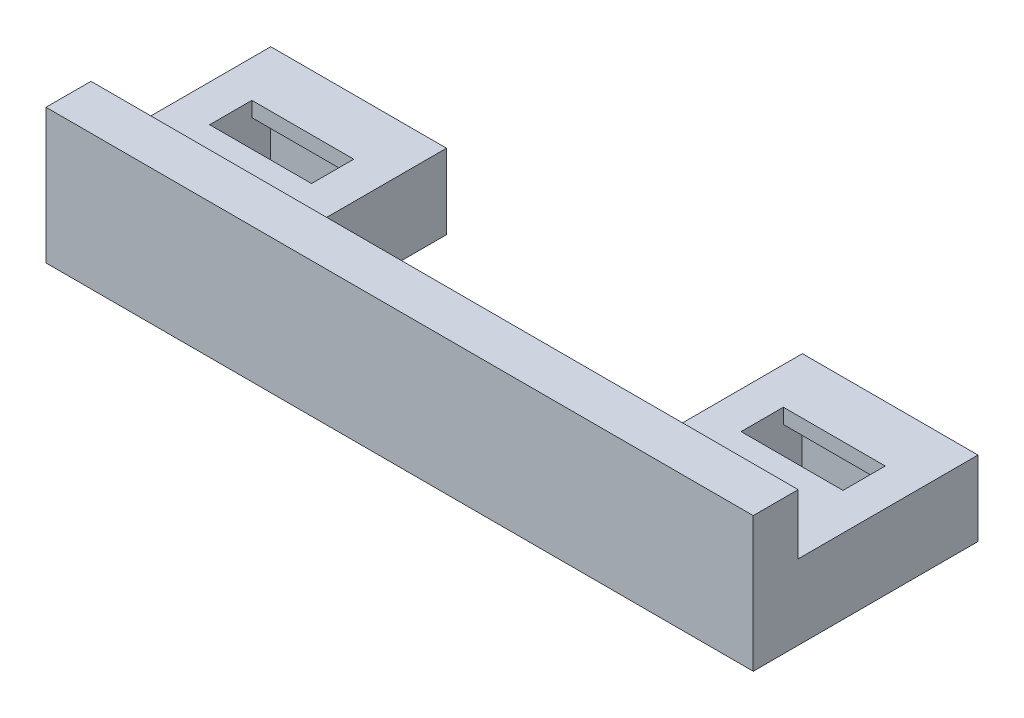
ISO-10303-21;
HEADER;
FILE_DESCRIPTION(('STEP AP214'),'2;1');
FILE_NAME('part.step','',(''),(''),'','','');
FILE_SCHEMA(('AUTOMOTIVE_DESIGN { 1 0 10303 214 1 1 1 1 }'));
ENDSEC;
DATA;
#1=APPLICATION_CONTEXT('core data for automotive mechanical design processes');
#2=APPLICATION_PROTOCOL_DEFINITION('international standard','automotive_design',2000,#1);
#3=PRODUCT_CONTEXT('',#1,'mechanical');
#4=PRODUCT('Part','Part','',(#3));
#5=PRODUCT_RELATED_PRODUCT_CATEGORY('part','',(#4));
#6=PRODUCT_DEFINITION_FORMATION('','',#4);
#7=PRODUCT_DEFINITION_CONTEXT('part definition',#1,'design');
#8=PRODUCT_DEFINITION('design','',#6,#7);
#9=PRODUCT_DEFINITION_SHAPE('','',#8);
#10=(LENGTH_UNIT() NAMED_UNIT(*) SI_UNIT(.MILLI.,.METRE.));
#11=(NAMED_UNIT(*) PLANE_ANGLE_UNIT() SI_UNIT($,.RADIAN.));
#12=(NAMED_UNIT(*) SI_UNIT($,.STERADIAN.) SOLID_ANGLE_UNIT());
#13=UNCERTAINTY_MEASURE_WITH_UNIT(LENGTH_MEASURE(1.E-05),#10,'distance_accuracy_value','');
#14=(GEOMETRIC_REPRESENTATION_CONTEXT(3) GLOBAL_UNCERTAINTY_ASSIGNED_CONTEXT((#13)) GLOBAL_UNIT_ASSIGNED_CONTEXT((#10,
#11,#12)) REPRESENTATION_CONTEXT('',''));
#15=CARTESIAN_POINT('',(0.,0.,0.));
#16=DIRECTION('',(0.,0.,1.));
#17=DIRECTION('',(1.,0.,0.));
#18=AXIS2_PLACEMENT_3D('',#15,#16,#17);
#19=CARTESIAN_POINT('',(0.,6.35,0.));
#20=DIRECTION('',(0.,-1.,0.));
#21=DIRECTION('',(0.,0.,-1.));
#22=AXIS2_PLACEMENT_3D('',#19,#20,#21);
#23=PLANE('',#22);
#24=DIRECTION('',(0.,0.,1.));
#25=VECTOR('',#24,1.);
#26=CARTESIAN_POINT('',(-11.238643735867,6.35,-23.8215313644361));
#27=LINE('',#26,#25);
#28=CARTESIAN_POINT('',(-11.238643735867,6.35,-23.8215313644361));
#29=VERTEX_POINT('',#28);
#30=CARTESIAN_POINT('',(-11.238643735867,6.35,-20.2401313644361));
#31=VERTEX_POINT('',#30);
#32=EDGE_CURVE('E257',#29,#31,#27,.T.);
#33=ORIENTED_EDGE('',*,*,#32,.F.);
#34=DIRECTION('',(-1.,0.,0.));
#35=VECTOR('',#34,1.);
#36=CARTESIAN_POINT('',(-11.238643735867,6.35,-23.8215313644361));
#37=LINE('',#36,#35);
#38=CARTESIAN_POINT('',(-2.60264373586703,6.35,-23.8215313644361));
#39=VERTEX_POINT('',#38);
#40=EDGE_CURVE('E265',#39,#29,#37,.T.);
#41=ORIENTED_EDGE('',*,*,#40,.F.);
#42=DIRECTION('',(0.,0.,-1.));
#43=VECTOR('',#42,1.);
#44=CARTESIAN_POINT('',(-2.60264373586703,6.35,-23.8215313644361));
#45=LINE('',#44,#43);
#46=CARTESIAN_POINT('',(-2.60264373586703,6.35,-20.2401313644361));
#47=VERTEX_POINT('',#46);
#48=EDGE_CURVE('E262',#47,#39,#45,.T.);
#49=ORIENTED_EDGE('',*,*,#48,.F.);
#50=DIRECTION('',(1.,0.,0.));
#51=VECTOR('',#50,1.);
#52=CARTESIAN_POINT('',(-11.238643735867,6.35,-20.2401313644361));
#53=LINE('',#52,#51);
#54=EDGE_CURVE('E259',#31,#47,#53,.T.);
#55=ORIENTED_EDGE('',*,*,#54,.F.);
#56=EDGE_LOOP('',(#33,#41,#49,#55));
#57=FACE_BOUND('',#56,.T.);
#58=DIRECTION('',(0.,0.,1.));
#59=VECTOR('',#58,1.);
#60=CARTESIAN_POINT('',(-56.285543735867,6.35,-23.8215313644361));
#61=LINE('',#60,#59);
#62=CARTESIAN_POINT('',(-56.285543735867,6.35,-23.8215313644361));
#63=VERTEX_POINT('',#62);
#64=CARTESIAN_POINT('',(-56.285543735867,6.35,-20.2401313644361));
#65=VERTEX_POINT('',#64);
#66=EDGE_CURVE('E282',#63,#65,#61,.T.);
#67=ORIENTED_EDGE('',*,*,#66,.F.);
#68=DIRECTION('',(-1.,0.,0.));
#69=VECTOR('',#68,1.);
#70=CARTESIAN_POINT('',(-56.285543735867,6.35,-23.8215313644361));
#71=LINE('',#70,#69);
#72=CARTESIAN_POINT('',(-47.649543735867,6.35,-23.8215313644361));
#73=VERTEX_POINT('',#72);
#74=EDGE_CURVE('E290',#73,#63,#71,.T.);
#75=ORIENTED_EDGE('',*,*,#74,.F.);
#76=DIRECTION('',(0.,0.,-1.));
#77=VECTOR('',#76,1.);
#78=CARTESIAN_POINT('',(-47.649543735867,6.35,-23.8215313644361));
#79=LINE('',#78,#77);
#80=CARTESIAN_POINT('',(-47.649543735867,6.35,-20.2401313644361));
#81=VERTEX_POINT('',#80);
#82=EDGE_CURVE('E287',#81,#73,#79,.T.);
#83=ORIENTED_EDGE('',*,*,#82,.F.);
#84=DIRECTION('',(1.,0.,0.));
#85=VECTOR('',#84,1.);
#86=CARTESIAN_POINT('',(-56.285543735867,6.35,-20.2401313644361));
#87=LINE('',#86,#85);
#88=EDGE_CURVE('E284',#65,#81,#87,.T.);
#89=ORIENTED_EDGE('',*,*,#88,.F.);
#90=EDGE_LOOP('',(#67,#75,#83,#89));
#91=FACE_BOUND('',#90,.T.);
#92=DIRECTION('',(-1.,0.,0.));
#93=VECTOR('',#92,1.);
#94=CARTESIAN_POINT('',(-59.422443735867,6.35,-13.3186313644361));
#95=LINE('',#94,#93);
#96=CARTESIAN_POINT('',(0.521556264132972,6.35,-13.3186313644361));
#97=VERTEX_POINT('',#96);
#98=CARTESIAN_POINT('',(-59.422443735867,6.35,-13.3186313644361));
#99=VERTEX_POINT('',#98);
#100=EDGE_CURVE('E48',#97,#99,#95,.T.);
#101=ORIENTED_EDGE('',*,*,#100,.F.);
#102=DIRECTION('',(0.,0.,-1.));
#103=VECTOR('',#102,1.);
#104=CARTESIAN_POINT('',(0.521556264132972,6.35,-9.50863136443608));
#105=LINE('',#104,#103);
#106=CARTESIAN_POINT('',(0.521556264132972,6.35,-28.5586313644361));
#107=VERTEX_POINT('',#106);
#108=EDGE_CURVE('E308',#97,#107,#105,.T.);
#109=ORIENTED_EDGE('',*,*,#108,.T.);
#110=DIRECTION('',(-1.,0.,0.));
#111=VECTOR('',#110,1.);
#112=CARTESIAN_POINT('',(-59.422443735867,6.35,-28.5586313644361));
#113=LINE('',#112,#111);
#114=CARTESIAN_POINT('',(-14.362843735867,6.35,-28.5586313644361));
#115=VERTEX_POINT('',#114);
#116=EDGE_CURVE('E311',#107,#115,#113,.T.);
#117=ORIENTED_EDGE('',*,*,#116,.T.);
#118=DIRECTION('',(0.,0.,1.));
#119=VECTOR('',#118,1.);
#120=CARTESIAN_POINT('',(-14.362843735867,6.35,0.));
#121=LINE('',#120,#119);
#122=CARTESIAN_POINT('',(-14.362843735867,6.35,-15.5284313644361));
#123=VERTEX_POINT('',#122);
#124=EDGE_CURVE('E11',#115,#123,#121,.T.);
#125=ORIENTED_EDGE('',*,*,#124,.T.);
#126=DIRECTION('',(-1.,0.,0.));
#127=VECTOR('',#126,1.);
#128=CARTESIAN_POINT('',(0.,6.35,-15.5284313644361));
#129=LINE('',#128,#127);
#130=CARTESIAN_POINT('',(-44.525343735867,6.35,-15.5284313644361));
#131=VERTEX_POINT('',#130);
#132=EDGE_CURVE('E216',#123,#131,#129,.T.);
#133=ORIENTED_EDGE('',*,*,#132,.T.);
#134=DIRECTION('',(0.,0.,-1.));
#135=VECTOR('',#134,1.);
#136=CARTESIAN_POINT('',(-44.525343735867,6.35,0.));
#137=LINE('',#136,#135);
#138=CARTESIAN_POINT('',(-44.525343735867,6.35,-28.5586313644361));
#139=VERTEX_POINT('',#138);
#140=EDGE_CURVE('E41',#131,#139,#137,.T.);
#141=ORIENTED_EDGE('',*,*,#140,.T.);
#142=CARTESIAN_POINT('',(-59.422443735867,6.35,-28.5586313644361));
#143=VERTEX_POINT('',#142);
#144=EDGE_CURVE('E310',#139,#143,#113,.T.);
#145=ORIENTED_EDGE('',*,*,#144,.T.);
#146=DIRECTION('',(0.,0.,1.));
#147=VECTOR('',#146,1.);
#148=CARTESIAN_POINT('',(-59.422443735867,6.35,-9.50863136443608));
#149=LINE('',#148,#147);
#150=EDGE_CURVE('E306',#143,#99,#149,.T.);
#151=ORIENTED_EDGE('',*,*,#150,.T.);
#152=EDGE_LOOP('',(#101,#109,#117,#125,#133,#141,#145,#151));
#153=FACE_BOUND('',#152,.T.);
#154=ADVANCED_FACE('F33',(#57,#91,#153),#23,.F.);
#155=CARTESIAN_POINT('',(-59.422443735867,5.08,-28.5586313644361));
#156=DIRECTION('',(0.,0.,1.));
#157=DIRECTION('',(1.,0.,0.));
#158=AXIS2_PLACEMENT_3D('',#155,#156,#157);
#159=PLANE('',#158);
#160=DIRECTION('',(-1.,0.,0.));
#161=VECTOR('',#160,1.);
#162=CARTESIAN_POINT('',(-59.422443735867,0.,-28.5586313644361));
#163=LINE('',#162,#161);
#164=CARTESIAN_POINT('',(0.521556264132972,0.,-28.5586313644361));
#165=VERTEX_POINT('',#164);
#166=CARTESIAN_POINT('',(-14.362843735867,0.,-28.5586313644361));
#167=VERTEX_POINT('',#166);
#168=EDGE_CURVE('E392',#165,#167,#163,.T.);
#169=ORIENTED_EDGE('',*,*,#168,.T.);
#170=DIRECTION('',(0.,-1.,0.));
#171=VECTOR('',#170,1.);
#172=CARTESIAN_POINT('',(-14.362843735867,30.48,-28.5586313644361));
#173=LINE('',#172,#171);
#174=EDGE_CURVE('E249',#115,#167,#173,.T.);
#175=ORIENTED_EDGE('',*,*,#174,.F.);
#176=ORIENTED_EDGE('',*,*,#116,.F.);
#177=DIRECTION('',(0.,-1.,0.));
#178=VECTOR('',#177,1.);
#179=CARTESIAN_POINT('',(0.521556264132972,5.08,-28.5586313644361));
#180=LINE('',#179,#178);
#181=EDGE_CURVE('E397',#107,#165,#180,.T.);
#182=ORIENTED_EDGE('',*,*,#181,.T.);
#183=EDGE_LOOP('',(#169,#175,#176,#182));
#184=FACE_BOUND('',#183,.T.);
#185=ADVANCED_FACE('F419',(#184),#159,.F.);
#186=CARTESIAN_POINT('',(0.,0.,0.));
#187=DIRECTION('',(0.,1.,0.));
#188=DIRECTION('',(0.,0.,1.));
#189=AXIS2_PLACEMENT_3D('',#186,#187,#188);
#190=PLANE('',#189);
#191=DIRECTION('',(0.,0.,-1.));
#192=VECTOR('',#191,1.);
#193=CARTESIAN_POINT('',(-47.649543735867,0.,-18.6526313644361));
#194=LINE('',#193,#192);
#195=CARTESIAN_POINT('',(-47.649543735867,0.,-18.6526313644361));
#196=VERTEX_POINT('',#195);
#197=CARTESIAN_POINT('',(-47.649543735867,0.,-25.4090313644361));
#198=VERTEX_POINT('',#197);
#199=EDGE_CURVE('E350',#196,#198,#194,.T.);
#200=ORIENTED_EDGE('',*,*,#199,.T.);
#201=DIRECTION('',(-1.,0.,0.));
#202=VECTOR('',#201,1.);
#203=CARTESIAN_POINT('',(-47.649543735867,0.,-25.4090313644361));
#204=LINE('',#203,#202);
#205=CARTESIAN_POINT('',(-56.285543735867,0.,-25.4090313644361));
#206=VERTEX_POINT('',#205);
#207=EDGE_CURVE('E368',#198,#206,#204,.T.);
#208=ORIENTED_EDGE('',*,*,#207,.T.);
#209=DIRECTION('',(0.,0.,1.));
#210=VECTOR('',#209,1.);
#211=CARTESIAN_POINT('',(-56.285543735867,0.,-18.6526313644361));
#212=LINE('',#211,#210);
#213=CARTESIAN_POINT('',(-56.285543735867,0.,-18.6526313644361));
#214=VERTEX_POINT('',#213);
#215=EDGE_CURVE('E371',#206,#214,#212,.T.);
#216=ORIENTED_EDGE('',*,*,#215,.T.);
#217=DIRECTION('',(1.,0.,0.));
#218=VECTOR('',#217,1.);
#219=CARTESIAN_POINT('',(-47.649543735867,0.,-18.6526313644361));
#220=LINE('',#219,#218);
#221=EDGE_CURVE('E374',#214,#196,#220,.T.);
#222=ORIENTED_EDGE('',*,*,#221,.T.);
#223=EDGE_LOOP('',(#200,#208,#216,#222));
#224=FACE_BOUND('',#223,.T.);
#225=DIRECTION('',(-1.,0.,0.));
#226=VECTOR('',#225,1.);
#227=CARTESIAN_POINT('',(-14.362843735867,0.,-15.5284313644361));
#228=LINE('',#227,#226);
#229=CARTESIAN_POINT('',(-14.362843735867,0.,-15.5284313644361));
#230=VERTEX_POINT('',#229);
#231=CARTESIAN_POINT('',(-44.525343735867,0.,-15.5284313644361));
#232=VERTEX_POINT('',#231);
#233=EDGE_CURVE('E244',#230,#232,#228,.T.);
#234=ORIENTED_EDGE('',*,*,#233,.F.);
#235=DIRECTION('',(0.,0.,1.));
#236=VECTOR('',#235,1.);
#237=CARTESIAN_POINT('',(-14.362843735867,0.,-28.5586313644361));
#238=LINE('',#237,#236);
#239=EDGE_CURVE('E241',#167,#230,#238,.T.);
#240=ORIENTED_EDGE('',*,*,#239,.F.);
#241=ORIENTED_EDGE('',*,*,#168,.F.);
#242=DIRECTION('',(0.,0.,-1.));
#243=VECTOR('',#242,1.);
#244=CARTESIAN_POINT('',(0.521556264132972,0.,-28.5586313644361));
#245=LINE('',#244,#243);
#246=CARTESIAN_POINT('',(0.521556264132974,0.,-9.50863136443608));
#247=VERTEX_POINT('',#246);
#248=EDGE_CURVE('E389',#247,#165,#245,.T.);
#249=ORIENTED_EDGE('',*,*,#248,.F.);
#250=DIRECTION('',(1.,0.,0.));
#251=VECTOR('',#250,1.);
#252=CARTESIAN_POINT('',(-59.422443735867,0.,-9.50863136443608));
#253=LINE('',#252,#251);
#254=CARTESIAN_POINT('',(-59.422443735867,0.,-9.50863136443608));
#255=VERTEX_POINT('',#254);
#256=EDGE_CURVE('E387',#255,#247,#253,.T.);
#257=ORIENTED_EDGE('',*,*,#256,.F.);
#258=DIRECTION('',(0.,0.,1.));
#259=VECTOR('',#258,1.);
#260=CARTESIAN_POINT('',(-59.422443735867,0.,-28.5586313644361));
#261=LINE('',#260,#259);
#262=CARTESIAN_POINT('',(-59.422443735867,0.,-28.5586313644361));
#263=VERTEX_POINT('',#262);
#264=EDGE_CURVE('E214',#263,#255,#261,.T.);
#265=ORIENTED_EDGE('',*,*,#264,.F.);
#266=CARTESIAN_POINT('',(-44.525343735867,0.,-28.5586313644361));
#267=VERTEX_POINT('',#266);
#268=EDGE_CURVE('E391',#267,#263,#163,.T.);
#269=ORIENTED_EDGE('',*,*,#268,.F.);
#270=DIRECTION('',(0.,0.,-1.));
#271=VECTOR('',#270,1.);
#272=CARTESIAN_POINT('',(-44.525343735867,0.,-28.5586313644361));
#273=LINE('',#272,#271);
#274=EDGE_CURVE('E246',#232,#267,#273,.T.);
#275=ORIENTED_EDGE('',*,*,#274,.F.);
#276=EDGE_LOOP('',(#234,#240,#241,#249,#257,#265,#269,#275));
#277=FACE_BOUND('',#276,.T.);
#278=DIRECTION('',(0.,0.,1.));
#279=VECTOR('',#278,1.);
#280=CARTESIAN_POINT('',(-11.238643735867,0.,-18.6526313644361));
#281=LINE('',#280,#279);
#282=CARTESIAN_POINT('',(-11.238643735867,0.,-25.4090313644361));
#283=VERTEX_POINT('',#282);
#284=CARTESIAN_POINT('',(-11.238643735867,0.,-18.6526313644361));
#285=VERTEX_POINT('',#284);
#286=EDGE_CURVE('E314',#283,#285,#281,.T.);
#287=ORIENTED_EDGE('',*,*,#286,.T.);
#288=DIRECTION('',(1.,0.,0.));
#289=VECTOR('',#288,1.);
#290=CARTESIAN_POINT('',(-11.238643735867,0.,-18.6526313644361));
#291=LINE('',#290,#289);
#292=CARTESIAN_POINT('',(-2.60264373586703,0.,-18.6526313644361));
#293=VERTEX_POINT('',#292);
#294=EDGE_CURVE('E332',#285,#293,#291,.T.);
#295=ORIENTED_EDGE('',*,*,#294,.T.);
#296=DIRECTION('',(0.,0.,-1.));
#297=VECTOR('',#296,1.);
#298=CARTESIAN_POINT('',(-2.60264373586703,0.,-18.6526313644361));
#299=LINE('',#298,#297);
#300=CARTESIAN_POINT('',(-2.60264373586703,0.,-25.4090313644361));
#301=VERTEX_POINT('',#300);
#302=EDGE_CURVE('E335',#293,#301,#299,.T.);
#303=ORIENTED_EDGE('',*,*,#302,.T.);
#304=DIRECTION('',(-1.,0.,0.));
#305=VECTOR('',#304,1.);
#306=CARTESIAN_POINT('',(-11.238643735867,0.,-25.4090313644361));
#307=LINE('',#306,#305);
#308=EDGE_CURVE('E338',#301,#283,#307,.T.);
#309=ORIENTED_EDGE('',*,*,#308,.T.);
#310=EDGE_LOOP('',(#287,#295,#303,#309));
#311=FACE_BOUND('',#310,.T.);
#312=ADVANCED_FACE('F427',(#224,#277,#311),#190,.F.);
#313=CARTESIAN_POINT('',(-59.422443735867,5.08,-28.5586313644361));
#314=DIRECTION('',(1.,0.,0.));
#315=DIRECTION('',(0.,0.,-1.));
#316=AXIS2_PLACEMENT_3D('',#313,#314,#315);
#317=PLANE('',#316);
#318=ORIENTED_EDGE('',*,*,#264,.T.);
#319=DIRECTION('',(0.,-1.,0.));
#320=VECTOR('',#319,1.);
#321=CARTESIAN_POINT('',(-59.422443735867,5.08,-9.50863136443608));
#322=LINE('',#321,#320);
#323=CARTESIAN_POINT('',(-59.422443735867,11.43,-9.50863136443608));
#324=VERTEX_POINT('',#323);
#325=EDGE_CURVE('E207',#324,#255,#322,.T.);
#326=ORIENTED_EDGE('',*,*,#325,.F.);
#327=DIRECTION('',(0.,0.,1.));
#328=VECTOR('',#327,1.);
#329=CARTESIAN_POINT('',(-59.422443735867,11.43,-9.50863136443608));
#330=LINE('',#329,#328);
#331=CARTESIAN_POINT('',(-59.422443735867,11.43,-13.3186313644361));
#332=VERTEX_POINT('',#331);
#333=EDGE_CURVE('E211',#332,#324,#330,.T.);
#334=ORIENTED_EDGE('',*,*,#333,.F.);
#335=DIRECTION('',(0.,-1.,0.));
#336=VECTOR('',#335,1.);
#337=CARTESIAN_POINT('',(-59.422443735867,11.43,-13.3186313644361));
#338=LINE('',#337,#336);
#339=EDGE_CURVE('E235',#332,#99,#338,.T.);
#340=ORIENTED_EDGE('',*,*,#339,.T.);
#341=ORIENTED_EDGE('',*,*,#150,.F.);
#342=DIRECTION('',(0.,-1.,0.));
#343=VECTOR('',#342,1.);
#344=CARTESIAN_POINT('',(-59.422443735867,5.08,-28.5586313644361));
#345=LINE('',#344,#343);
#346=EDGE_CURVE('E395',#143,#263,#345,.T.);
#347=ORIENTED_EDGE('',*,*,#346,.T.);
#348=EDGE_LOOP('',(#318,#326,#334,#340,#341,#347));
#349=FACE_BOUND('',#348,.T.);
#350=ADVANCED_FACE('F35',(#349),#317,.F.);
#351=CARTESIAN_POINT('',(-59.422443735867,5.08,-9.50863136443608));
#352=DIRECTION('',(0.,0.,-1.));
#353=DIRECTION('',(-1.,0.,0.));
#354=AXIS2_PLACEMENT_3D('',#351,#352,#353);
#355=PLANE('',#354);
#356=ORIENTED_EDGE('',*,*,#256,.T.);
#357=DIRECTION('',(0.,-1.,0.));
#358=VECTOR('',#357,1.);
#359=CARTESIAN_POINT('',(0.521556264132974,5.08,-9.50863136443608));
#360=LINE('',#359,#358);
#361=CARTESIAN_POINT('',(0.521556264132972,11.43,-9.50863136443608));
#362=VERTEX_POINT('',#361);
#363=EDGE_CURVE('E217',#362,#247,#360,.T.);
#364=ORIENTED_EDGE('',*,*,#363,.F.);
#365=DIRECTION('',(1.,0.,0.));
#366=VECTOR('',#365,1.);
#367=CARTESIAN_POINT('',(-59.422443735867,11.43,-9.50863136443608));
#368=LINE('',#367,#366);
#369=EDGE_CURVE('E220',#324,#362,#368,.T.);
#370=ORIENTED_EDGE('',*,*,#369,.F.);
#371=ORIENTED_EDGE('',*,*,#325,.T.);
#372=EDGE_LOOP('',(#356,#364,#370,#371));
#373=FACE_BOUND('',#372,.T.);
#374=ADVANCED_FACE('F221',(#373),#355,.F.);
#375=CARTESIAN_POINT('',(0.521556264132972,5.08,-28.5586313644361));
#376=DIRECTION('',(-1.,0.,0.));
#377=DIRECTION('',(0.,0.,1.));
#378=AXIS2_PLACEMENT_3D('',#375,#376,#377);
#379=PLANE('',#378);
#380=ORIENTED_EDGE('',*,*,#248,.T.);
#381=ORIENTED_EDGE('',*,*,#181,.F.);
#382=ORIENTED_EDGE('',*,*,#108,.F.);
#383=DIRECTION('',(0.,-1.,0.));
#384=VECTOR('',#383,1.);
#385=CARTESIAN_POINT('',(0.521556264132972,11.43,-13.3186313644361));
#386=LINE('',#385,#384);
#387=CARTESIAN_POINT('',(0.521556264132972,11.43,-13.3186313644361));
#388=VERTEX_POINT('',#387);
#389=EDGE_CURVE('E238',#388,#97,#386,.T.);
#390=ORIENTED_EDGE('',*,*,#389,.F.);
#391=DIRECTION('',(0.,0.,-1.));
#392=VECTOR('',#391,1.);
#393=CARTESIAN_POINT('',(0.521556264132972,11.43,-9.50863136443608));
#394=LINE('',#393,#392);
#395=EDGE_CURVE('E225',#362,#388,#394,.T.);
#396=ORIENTED_EDGE('',*,*,#395,.F.);
#397=ORIENTED_EDGE('',*,*,#363,.T.);
#398=EDGE_LOOP('',(#380,#381,#382,#390,#396,#397));
#399=FACE_BOUND('',#398,.T.);
#400=ADVANCED_FACE('F414',(#399),#379,.F.);
#401=ORIENTED_EDGE('',*,*,#144,.F.);
#402=DIRECTION('',(0.,-1.,0.));
#403=VECTOR('',#402,1.);
#404=CARTESIAN_POINT('',(-44.525343735867,30.48,-28.5586313644361));
#405=LINE('',#404,#403);
#406=EDGE_CURVE('E252',#139,#267,#405,.T.);
#407=ORIENTED_EDGE('',*,*,#406,.T.);
#408=ORIENTED_EDGE('',*,*,#268,.T.);
#409=ORIENTED_EDGE('',*,*,#346,.F.);
#410=EDGE_LOOP('',(#401,#407,#408,#409));
#411=FACE_BOUND('',#410,.T.);
#412=ADVANCED_FACE('F407',(#411),#159,.F.);
#413=CARTESIAN_POINT('',(-47.649543735867,5.08,-18.6526313644361));
#414=DIRECTION('',(-1.,0.,0.));
#415=DIRECTION('',(0.,0.,1.));
#416=AXIS2_PLACEMENT_3D('',#413,#414,#415);
#417=PLANE('',#416);
#418=ORIENTED_EDGE('',*,*,#199,.F.);
#419=DIRECTION('',(0.,-1.,0.));
#420=VECTOR('',#419,1.);
#421=CARTESIAN_POINT('',(-47.649543735867,5.08,-18.6526313644361));
#422=LINE('',#421,#420);
#423=CARTESIAN_POINT('',(-47.649543735867,5.08,-18.6526313644361));
#424=VERTEX_POINT('',#423);
#425=EDGE_CURVE('E365',#424,#196,#422,.T.);
#426=ORIENTED_EDGE('',*,*,#425,.F.);
#427=DIRECTION('',(0.,0.,-1.));
#428=VECTOR('',#427,1.);
#429=CARTESIAN_POINT('',(-47.649543735867,5.08,-18.6526313644361));
#430=LINE('',#429,#428);
#431=CARTESIAN_POINT('',(-47.649543735867,5.08,-20.2401313644361));
#432=VERTEX_POINT('',#431);
#433=EDGE_CURVE('E351',#424,#432,#430,.T.);
#434=ORIENTED_EDGE('',*,*,#433,.T.);
#435=DIRECTION('',(0.,-1.,0.));
#436=VECTOR('',#435,1.);
#437=CARTESIAN_POINT('',(-47.649543735867,6.35,-20.2401313644361));
#438=LINE('',#437,#436);
#439=EDGE_CURVE('E301',#81,#432,#438,.T.);
#440=ORIENTED_EDGE('',*,*,#439,.F.);
#441=ORIENTED_EDGE('',*,*,#82,.T.);
#442=DIRECTION('',(0.,-1.,0.));
#443=VECTOR('',#442,1.);
#444=CARTESIAN_POINT('',(-47.649543735867,6.35,-23.8215313644361));
#445=LINE('',#444,#443);
#446=CARTESIAN_POINT('',(-47.649543735867,5.08,-23.8215313644361));
#447=VERTEX_POINT('',#446);
#448=EDGE_CURVE('E298',#73,#447,#445,.T.);
#449=ORIENTED_EDGE('',*,*,#448,.T.);
#450=CARTESIAN_POINT('',(-47.649543735867,5.08,-25.4090313644361));
#451=VERTEX_POINT('',#450);
#452=EDGE_CURVE('E355',#447,#451,#430,.T.);
#453=ORIENTED_EDGE('',*,*,#452,.T.);
#454=DIRECTION('',(0.,-1.,0.));
#455=VECTOR('',#454,1.);
#456=CARTESIAN_POINT('',(-47.649543735867,5.08,-25.4090313644361));
#457=LINE('',#456,#455);
#458=EDGE_CURVE('E383',#451,#198,#457,.T.);
#459=ORIENTED_EDGE('',*,*,#458,.T.);
#460=EDGE_LOOP('',(#418,#426,#434,#440,#441,#449,#453,#459));
#461=FACE_BOUND('',#460,.T.);
#462=ADVANCED_FACE('F488',(#461),#417,.T.);
#463=CARTESIAN_POINT('',(-47.649543735867,5.08,-25.4090313644361));
#464=DIRECTION('',(0.,0.,1.));
#465=DIRECTION('',(1.,0.,0.));
#466=AXIS2_PLACEMENT_3D('',#463,#464,#465);
#467=PLANE('',#466);
#468=ORIENTED_EDGE('',*,*,#207,.F.);
#469=ORIENTED_EDGE('',*,*,#458,.F.);
#470=DIRECTION('',(-1.,0.,0.));
#471=VECTOR('',#470,1.);
#472=CARTESIAN_POINT('',(-47.649543735867,5.08,-25.4090313644361));
#473=LINE('',#472,#471);
#474=CARTESIAN_POINT('',(-56.285543735867,5.08,-25.4090313644361));
#475=VERTEX_POINT('',#474);
#476=EDGE_CURVE('E354',#451,#475,#473,.T.);
#477=ORIENTED_EDGE('',*,*,#476,.T.);
#478=DIRECTION('',(0.,-1.,0.));
#479=VECTOR('',#478,1.);
#480=CARTESIAN_POINT('',(-56.285543735867,5.08,-25.4090313644361));
#481=LINE('',#480,#479);
#482=EDGE_CURVE('E381',#475,#206,#481,.T.);
#483=ORIENTED_EDGE('',*,*,#482,.T.);
#484=EDGE_LOOP('',(#468,#469,#477,#483));
#485=FACE_BOUND('',#484,.T.);
#486=ADVANCED_FACE('F484',(#485),#467,.T.);
#487=CARTESIAN_POINT('',(-56.285543735867,5.08,-18.6526313644361));
#488=DIRECTION('',(1.,0.,0.));
#489=DIRECTION('',(0.,0.,-1.));
#490=AXIS2_PLACEMENT_3D('',#487,#488,#489);
#491=PLANE('',#490);
#492=ORIENTED_EDGE('',*,*,#215,.F.);
#493=ORIENTED_EDGE('',*,*,#482,.F.);
#494=DIRECTION('',(0.,0.,1.));
#495=VECTOR('',#494,1.);
#496=CARTESIAN_POINT('',(-56.285543735867,5.08,-18.6526313644361));
#497=LINE('',#496,#495);
#498=CARTESIAN_POINT('',(-56.285543735867,5.08,-23.8215313644361));
#499=VERTEX_POINT('',#498);
#500=EDGE_CURVE('E359',#475,#499,#497,.T.);
#501=ORIENTED_EDGE('',*,*,#500,.T.);
#502=DIRECTION('',(0.,-1.,0.));
#503=VECTOR('',#502,1.);
#504=CARTESIAN_POINT('',(-56.285543735867,6.35,-23.8215313644361));
#505=LINE('',#504,#503);
#506=EDGE_CURVE('E292',#63,#499,#505,.T.);
#507=ORIENTED_EDGE('',*,*,#506,.F.);
#508=ORIENTED_EDGE('',*,*,#66,.T.);
#509=DIRECTION('',(0.,-1.,0.));
#510=VECTOR('',#509,1.);
#511=CARTESIAN_POINT('',(-56.285543735867,6.35,-20.2401313644361));
#512=LINE('',#511,#510);
#513=CARTESIAN_POINT('',(-56.285543735867,5.08,-20.2401313644361));
#514=VERTEX_POINT('',#513);
#515=EDGE_CURVE('E303',#65,#514,#512,.T.);
#516=ORIENTED_EDGE('',*,*,#515,.T.);
#517=CARTESIAN_POINT('',(-56.285543735867,5.08,-18.6526313644361));
#518=VERTEX_POINT('',#517);
#519=EDGE_CURVE('E358',#514,#518,#497,.T.);
#520=ORIENTED_EDGE('',*,*,#519,.T.);
#521=DIRECTION('',(0.,-1.,0.));
#522=VECTOR('',#521,1.);
#523=CARTESIAN_POINT('',(-56.285543735867,5.08,-18.6526313644361));
#524=LINE('',#523,#522);
#525=EDGE_CURVE('E379',#518,#214,#524,.T.);
#526=ORIENTED_EDGE('',*,*,#525,.T.);
#527=EDGE_LOOP('',(#492,#493,#501,#507,#508,#516,#520,#526));
#528=FACE_BOUND('',#527,.T.);
#529=ADVANCED_FACE('F480',(#528),#491,.T.);
#530=CARTESIAN_POINT('',(-47.649543735867,5.08,-18.6526313644361));
#531=DIRECTION('',(0.,0.,-1.));
#532=DIRECTION('',(-1.,0.,0.));
#533=AXIS2_PLACEMENT_3D('',#530,#531,#532);
#534=PLANE('',#533);
#535=ORIENTED_EDGE('',*,*,#221,.F.);
#536=ORIENTED_EDGE('',*,*,#525,.F.);
#537=DIRECTION('',(1.,0.,0.));
#538=VECTOR('',#537,1.);
#539=CARTESIAN_POINT('',(-47.649543735867,5.08,-18.6526313644361));
#540=LINE('',#539,#538);
#541=EDGE_CURVE('E362',#518,#424,#540,.T.);
#542=ORIENTED_EDGE('',*,*,#541,.T.);
#543=ORIENTED_EDGE('',*,*,#425,.T.);
#544=EDGE_LOOP('',(#535,#536,#542,#543));
#545=FACE_BOUND('',#544,.T.);
#546=ADVANCED_FACE('F476',(#545),#534,.T.);
#547=CARTESIAN_POINT('',(-11.238643735867,5.08,-18.6526313644361));
#548=DIRECTION('',(1.,0.,0.));
#549=DIRECTION('',(0.,0.,-1.));
#550=AXIS2_PLACEMENT_3D('',#547,#548,#549);
#551=PLANE('',#550);
#552=ORIENTED_EDGE('',*,*,#286,.F.);
#553=DIRECTION('',(0.,-1.,0.));
#554=VECTOR('',#553,1.);
#555=CARTESIAN_POINT('',(-11.238643735867,5.08,-25.4090313644361));
#556=LINE('',#555,#554);
#557=CARTESIAN_POINT('',(-11.238643735867,5.08,-25.4090313644361));
#558=VERTEX_POINT('',#557);
#559=EDGE_CURVE('E329',#558,#283,#556,.T.);
#560=ORIENTED_EDGE('',*,*,#559,.F.);
#561=DIRECTION('',(0.,0.,1.));
#562=VECTOR('',#561,1.);
#563=CARTESIAN_POINT('',(-11.238643735867,5.08,-18.6526313644361));
#564=LINE('',#563,#562);
#565=CARTESIAN_POINT('',(-11.238643735867,5.08,-23.8215313644361));
#566=VERTEX_POINT('',#565);
#567=EDGE_CURVE('E315',#558,#566,#564,.T.);
#568=ORIENTED_EDGE('',*,*,#567,.T.);
#569=DIRECTION('',(0.,-1.,0.));
#570=VECTOR('',#569,1.);
#571=CARTESIAN_POINT('',(-11.238643735867,6.35,-23.8215313644361));
#572=LINE('',#571,#570);
#573=EDGE_CURVE('E267',#29,#566,#572,.T.);
#574=ORIENTED_EDGE('',*,*,#573,.F.);
#575=ORIENTED_EDGE('',*,*,#32,.T.);
#576=DIRECTION('',(0.,-1.,0.));
#577=VECTOR('',#576,1.);
#578=CARTESIAN_POINT('',(-11.238643735867,6.35,-20.2401313644361));
#579=LINE('',#578,#577);
#580=CARTESIAN_POINT('',(-11.238643735867,5.08,-20.2401313644361));
#581=VERTEX_POINT('',#580);
#582=EDGE_CURVE('E278',#31,#581,#579,.T.);
#583=ORIENTED_EDGE('',*,*,#582,.T.);
#584=CARTESIAN_POINT('',(-11.238643735867,5.08,-18.6526313644361));
#585=VERTEX_POINT('',#584);
#586=EDGE_CURVE('E319',#581,#585,#564,.T.);
#587=ORIENTED_EDGE('',*,*,#586,.T.);
#588=DIRECTION('',(0.,-1.,0.));
#589=VECTOR('',#588,1.);
#590=CARTESIAN_POINT('',(-11.238643735867,5.08,-18.6526313644361));
#591=LINE('',#590,#589);
#592=EDGE_CURVE('E347',#585,#285,#591,.T.);
#593=ORIENTED_EDGE('',*,*,#592,.T.);
#594=EDGE_LOOP('',(#552,#560,#568,#574,#575,#583,#587,#593));
#595=FACE_BOUND('',#594,.T.);
#596=ADVANCED_FACE('F472',(#595),#551,.T.);
#597=CARTESIAN_POINT('',(-11.238643735867,5.08,-18.6526313644361));
#598=DIRECTION('',(0.,0.,-1.));
#599=DIRECTION('',(-1.,0.,0.));
#600=AXIS2_PLACEMENT_3D('',#597,#598,#599);
#601=PLANE('',#600);
#602=ORIENTED_EDGE('',*,*,#294,.F.);
#603=ORIENTED_EDGE('',*,*,#592,.F.);
#604=DIRECTION('',(1.,0.,0.));
#605=VECTOR('',#604,1.);
#606=CARTESIAN_POINT('',(-11.238643735867,5.08,-18.6526313644361));
#607=LINE('',#606,#605);
#608=CARTESIAN_POINT('',(-2.60264373586703,5.08,-18.6526313644361));
#609=VERTEX_POINT('',#608);
#610=EDGE_CURVE('E318',#585,#609,#607,.T.);
#611=ORIENTED_EDGE('',*,*,#610,.T.);
#612=DIRECTION('',(0.,-1.,0.));
#613=VECTOR('',#612,1.);
#614=CARTESIAN_POINT('',(-2.60264373586703,5.08,-18.6526313644361));
#615=LINE('',#614,#613);
#616=EDGE_CURVE('E345',#609,#293,#615,.T.);
#617=ORIENTED_EDGE('',*,*,#616,.T.);
#618=EDGE_LOOP('',(#602,#603,#611,#617));
#619=FACE_BOUND('',#618,.T.);
#620=ADVANCED_FACE('F468',(#619),#601,.T.);
#621=CARTESIAN_POINT('',(-2.60264373586703,5.08,-18.6526313644361));
#622=DIRECTION('',(-1.,0.,0.));
#623=DIRECTION('',(0.,0.,1.));
#624=AXIS2_PLACEMENT_3D('',#621,#622,#623);
#625=PLANE('',#624);
#626=ORIENTED_EDGE('',*,*,#302,.F.);
#627=ORIENTED_EDGE('',*,*,#616,.F.);
#628=DIRECTION('',(0.,0.,-1.));
#629=VECTOR('',#628,1.);
#630=CARTESIAN_POINT('',(-2.60264373586703,5.08,-18.6526313644361));
#631=LINE('',#630,#629);
#632=CARTESIAN_POINT('',(-2.60264373586703,5.08,-20.2401313644361));
#633=VERTEX_POINT('',#632);
#634=EDGE_CURVE('E323',#609,#633,#631,.T.);
#635=ORIENTED_EDGE('',*,*,#634,.T.);
#636=DIRECTION('',(0.,-1.,0.));
#637=VECTOR('',#636,1.);
#638=CARTESIAN_POINT('',(-2.60264373586703,6.35,-20.2401313644361));
#639=LINE('',#638,#637);
#640=EDGE_CURVE('E276',#47,#633,#639,.T.);
#641=ORIENTED_EDGE('',*,*,#640,.F.);
#642=ORIENTED_EDGE('',*,*,#48,.T.);
#643=DIRECTION('',(0.,-1.,0.));
#644=VECTOR('',#643,1.);
#645=CARTESIAN_POINT('',(-2.60264373586703,6.35,-23.8215313644361));
#646=LINE('',#645,#644);
#647=CARTESIAN_POINT('',(-2.60264373586703,5.08,-23.8215313644361));
#648=VERTEX_POINT('',#647);
#649=EDGE_CURVE('E273',#39,#648,#646,.T.);
#650=ORIENTED_EDGE('',*,*,#649,.T.);
#651=CARTESIAN_POINT('',(-2.60264373586703,5.08,-25.4090313644361));
#652=VERTEX_POINT('',#651);
#653=EDGE_CURVE('E322',#648,#652,#631,.T.);
#654=ORIENTED_EDGE('',*,*,#653,.T.);
#655=DIRECTION('',(0.,-1.,0.));
#656=VECTOR('',#655,1.);
#657=CARTESIAN_POINT('',(-2.60264373586703,5.08,-25.4090313644361));
#658=LINE('',#657,#656);
#659=EDGE_CURVE('E343',#652,#301,#658,.T.);
#660=ORIENTED_EDGE('',*,*,#659,.T.);
#661=EDGE_LOOP('',(#626,#627,#635,#641,#642,#650,#654,#660));
#662=FACE_BOUND('',#661,.T.);
#663=ADVANCED_FACE('F464',(#662),#625,.T.);
#664=CARTESIAN_POINT('',(-11.238643735867,5.08,-25.4090313644361));
#665=DIRECTION('',(0.,0.,1.));
#666=DIRECTION('',(1.,0.,0.));
#667=AXIS2_PLACEMENT_3D('',#664,#665,#666);
#668=PLANE('',#667);
#669=ORIENTED_EDGE('',*,*,#308,.F.);
#670=ORIENTED_EDGE('',*,*,#659,.F.);
#671=DIRECTION('',(-1.,0.,0.));
#672=VECTOR('',#671,1.);
#673=CARTESIAN_POINT('',(-11.238643735867,5.08,-25.4090313644361));
#674=LINE('',#673,#672);
#675=EDGE_CURVE('E326',#652,#558,#674,.T.);
#676=ORIENTED_EDGE('',*,*,#675,.T.);
#677=ORIENTED_EDGE('',*,*,#559,.T.);
#678=EDGE_LOOP('',(#669,#670,#676,#677));
#679=FACE_BOUND('',#678,.T.);
#680=ADVANCED_FACE('F459',(#679),#668,.T.);
#681=CARTESIAN_POINT('',(0.,5.08,0.));
#682=DIRECTION('',(0.,-1.,0.));
#683=DIRECTION('',(0.,0.,-1.));
#684=AXIS2_PLACEMENT_3D('',#681,#682,#683);
#685=PLANE('',#684);
#686=ORIENTED_EDGE('',*,*,#452,.F.);
#687=DIRECTION('',(-1.,0.,0.));
#688=VECTOR('',#687,1.);
#689=CARTESIAN_POINT('',(-56.285543735867,5.08,-23.8215313644361));
#690=LINE('',#689,#688);
#691=EDGE_CURVE('E285',#447,#499,#690,.T.);
#692=ORIENTED_EDGE('',*,*,#691,.T.);
#693=ORIENTED_EDGE('',*,*,#500,.F.);
#694=ORIENTED_EDGE('',*,*,#476,.F.);
#695=EDGE_LOOP('',(#686,#692,#693,#694));
#696=FACE_BOUND('',#695,.T.);
#697=ADVANCED_FACE('F455',(#696),#685,.T.);
#698=ORIENTED_EDGE('',*,*,#433,.F.);
#699=ORIENTED_EDGE('',*,*,#541,.F.);
#700=ORIENTED_EDGE('',*,*,#519,.F.);
#701=DIRECTION('',(1.,0.,0.));
#702=VECTOR('',#701,1.);
#703=CARTESIAN_POINT('',(-56.285543735867,5.08,-20.2401313644361));
#704=LINE('',#703,#702);
#705=EDGE_CURVE('E281',#514,#432,#704,.T.);
#706=ORIENTED_EDGE('',*,*,#705,.T.);
#707=EDGE_LOOP('',(#698,#699,#700,#706));
#708=FACE_BOUND('',#707,.T.);
#709=ADVANCED_FACE('F458',(#708),#685,.T.);
#710=ORIENTED_EDGE('',*,*,#586,.F.);
#711=DIRECTION('',(1.,0.,0.));
#712=VECTOR('',#711,1.);
#713=CARTESIAN_POINT('',(-11.238643735867,5.08,-20.2401313644361));
#714=LINE('',#713,#712);
#715=EDGE_CURVE('E251',#581,#633,#714,.T.);
#716=ORIENTED_EDGE('',*,*,#715,.T.);
#717=ORIENTED_EDGE('',*,*,#634,.F.);
#718=ORIENTED_EDGE('',*,*,#610,.F.);
#719=EDGE_LOOP('',(#710,#716,#717,#718));
#720=FACE_BOUND('',#719,.T.);
#721=ADVANCED_FACE('F562',(#720),#685,.T.);
#722=ORIENTED_EDGE('',*,*,#567,.F.);
#723=ORIENTED_EDGE('',*,*,#675,.F.);
#724=ORIENTED_EDGE('',*,*,#653,.F.);
#725=DIRECTION('',(-1.,0.,0.));
#726=VECTOR('',#725,1.);
#727=CARTESIAN_POINT('',(-11.238643735867,5.08,-23.8215313644361));
#728=LINE('',#727,#726);
#729=EDGE_CURVE('E260',#648,#566,#728,.T.);
#730=ORIENTED_EDGE('',*,*,#729,.T.);
#731=EDGE_LOOP('',(#722,#723,#724,#730));
#732=FACE_BOUND('',#731,.T.);
#733=ADVANCED_FACE('F461',(#732),#685,.T.);
#734=CARTESIAN_POINT('',(-56.285543735867,6.35,-20.2401313644361));
#735=DIRECTION('',(0.,0.,-1.));
#736=DIRECTION('',(-1.,0.,0.));
#737=AXIS2_PLACEMENT_3D('',#734,#735,#736);
#738=PLANE('',#737);
#739=ORIENTED_EDGE('',*,*,#705,.F.);
#740=ORIENTED_EDGE('',*,*,#515,.F.);
#741=ORIENTED_EDGE('',*,*,#88,.T.);
#742=ORIENTED_EDGE('',*,*,#439,.T.);
#743=EDGE_LOOP('',(#739,#740,#741,#742));
#744=FACE_BOUND('',#743,.T.);
#745=ADVANCED_FACE('F453',(#744),#738,.T.);
#746=CARTESIAN_POINT('',(-56.285543735867,6.35,-23.8215313644361));
#747=DIRECTION('',(0.,0.,1.));
#748=DIRECTION('',(1.,0.,0.));
#749=AXIS2_PLACEMENT_3D('',#746,#747,#748);
#750=PLANE('',#749);
#751=ORIENTED_EDGE('',*,*,#691,.F.);
#752=ORIENTED_EDGE('',*,*,#448,.F.);
#753=ORIENTED_EDGE('',*,*,#74,.T.);
#754=ORIENTED_EDGE('',*,*,#506,.T.);
#755=EDGE_LOOP('',(#751,#752,#753,#754));
#756=FACE_BOUND('',#755,.T.);
#757=ADVANCED_FACE('F536',(#756),#750,.T.);
#758=CARTESIAN_POINT('',(-11.238643735867,6.35,-20.2401313644361));
#759=DIRECTION('',(0.,0.,-1.));
#760=DIRECTION('',(-1.,0.,0.));
#761=AXIS2_PLACEMENT_3D('',#758,#759,#760);
#762=PLANE('',#761);
#763=ORIENTED_EDGE('',*,*,#715,.F.);
#764=ORIENTED_EDGE('',*,*,#582,.F.);
#765=ORIENTED_EDGE('',*,*,#54,.T.);
#766=ORIENTED_EDGE('',*,*,#640,.T.);
#767=EDGE_LOOP('',(#763,#764,#765,#766));
#768=FACE_BOUND('',#767,.T.);
#769=ADVANCED_FACE('F525',(#768),#762,.T.);
#770=CARTESIAN_POINT('',(-11.238643735867,6.35,-23.8215313644361));
#771=DIRECTION('',(0.,0.,1.));
#772=DIRECTION('',(1.,0.,0.));
#773=AXIS2_PLACEMENT_3D('',#770,#771,#772);
#774=PLANE('',#773);
#775=ORIENTED_EDGE('',*,*,#729,.F.);
#776=ORIENTED_EDGE('',*,*,#649,.F.);
#777=ORIENTED_EDGE('',*,*,#40,.T.);
#778=ORIENTED_EDGE('',*,*,#573,.T.);
#779=EDGE_LOOP('',(#775,#776,#777,#778));
#780=FACE_BOUND('',#779,.T.);
#781=ADVANCED_FACE('F520',(#780),#774,.T.);
#782=CARTESIAN_POINT('',(-14.362843735867,30.48,-28.5586313644361));
#783=DIRECTION('',(1.,0.,0.));
#784=DIRECTION('',(0.,0.,-1.));
#785=AXIS2_PLACEMENT_3D('',#782,#783,#784);
#786=PLANE('',#785);
#787=ORIENTED_EDGE('',*,*,#174,.T.);
#788=ORIENTED_EDGE('',*,*,#239,.T.);
#789=DIRECTION('',(0.,-1.,0.));
#790=VECTOR('',#789,1.);
#791=CARTESIAN_POINT('',(-14.362843735867,30.48,-15.5284313644361));
#792=LINE('',#791,#790);
#793=EDGE_CURVE('E248',#123,#230,#792,.T.);
#794=ORIENTED_EDGE('',*,*,#793,.F.);
#795=ORIENTED_EDGE('',*,*,#124,.F.);
#796=EDGE_LOOP('',(#787,#788,#794,#795));
#797=FACE_BOUND('',#796,.T.);
#798=ADVANCED_FACE('F423',(#797),#786,.F.);
#799=CARTESIAN_POINT('',(-44.525343735867,30.48,-28.5586313644361));
#800=DIRECTION('',(-1.,0.,0.));
#801=DIRECTION('',(0.,0.,1.));
#802=AXIS2_PLACEMENT_3D('',#799,#800,#801);
#803=PLANE('',#802);
#804=DIRECTION('',(0.,-1.,0.));
#805=VECTOR('',#804,1.);
#806=CARTESIAN_POINT('',(-44.525343735867,30.48,-15.5284313644361));
#807=LINE('',#806,#805);
#808=EDGE_CURVE('E56',#131,#232,#807,.T.);
#809=ORIENTED_EDGE('',*,*,#808,.T.);
#810=ORIENTED_EDGE('',*,*,#274,.T.);
#811=ORIENTED_EDGE('',*,*,#406,.F.);
#812=ORIENTED_EDGE('',*,*,#140,.F.);
#813=EDGE_LOOP('',(#809,#810,#811,#812));
#814=FACE_BOUND('',#813,.T.);
#815=ADVANCED_FACE('F433',(#814),#803,.F.);
#816=CARTESIAN_POINT('',(-14.362843735867,30.48,-15.5284313644361));
#817=DIRECTION('',(0.,0.,1.));
#818=DIRECTION('',(1.,0.,0.));
#819=AXIS2_PLACEMENT_3D('',#816,#817,#818);
#820=PLANE('',#819);
#821=ORIENTED_EDGE('',*,*,#793,.T.);
#822=ORIENTED_EDGE('',*,*,#233,.T.);
#823=ORIENTED_EDGE('',*,*,#808,.F.);
#824=ORIENTED_EDGE('',*,*,#132,.F.);
#825=EDGE_LOOP('',(#821,#822,#823,#824));
#826=FACE_BOUND('',#825,.T.);
#827=ADVANCED_FACE('F431',(#826),#820,.F.);
#828=CARTESIAN_POINT('',(-59.422443735867,11.43,-13.3186313644361));
#829=DIRECTION('',(0.,0.,1.));
#830=DIRECTION('',(1.,0.,0.));
#831=AXIS2_PLACEMENT_3D('',#828,#829,#830);
#832=PLANE('',#831);
#833=ORIENTED_EDGE('',*,*,#100,.T.);
#834=ORIENTED_EDGE('',*,*,#339,.F.);
#835=DIRECTION('',(-1.,0.,0.));
#836=VECTOR('',#835,1.);
#837=CARTESIAN_POINT('',(-59.422443735867,11.43,-13.3186313644361));
#838=LINE('',#837,#836);
#839=EDGE_CURVE('E229',#388,#332,#838,.T.);
#840=ORIENTED_EDGE('',*,*,#839,.F.);
#841=ORIENTED_EDGE('',*,*,#389,.T.);
#842=EDGE_LOOP('',(#833,#834,#840,#841));
#843=FACE_BOUND('',#842,.T.);
#844=ADVANCED_FACE('F411',(#843),#832,.F.);
#845=CARTESIAN_POINT('',(0.,11.43,0.));
#846=DIRECTION('',(0.,-1.,0.));
#847=DIRECTION('',(0.,0.,-1.));
#848=AXIS2_PLACEMENT_3D('',#845,#846,#847);
#849=PLANE('',#848);
#850=ORIENTED_EDGE('',*,*,#333,.T.);
#851=ORIENTED_EDGE('',*,*,#369,.T.);
#852=ORIENTED_EDGE('',*,*,#395,.T.);
#853=ORIENTED_EDGE('',*,*,#839,.T.);
#854=EDGE_LOOP('',(#850,#851,#852,#853));
#855=FACE_BOUND('',#854,.T.);
#856=ADVANCED_FACE('F227',(#855),#849,.F.);
#857=CLOSED_SHELL('',(#154,#185,#312,#350,#374,#400,#412,#462,#486,#529,#546,#596,#620,#663,
#680,#697,#709,#721,#733,#745,#757,#769,#781,#798,#815,#827,#844,#856));
#858=MANIFOLD_SOLID_BREP('B2',#857);
#859=ADVANCED_BREP_SHAPE_REPRESENTATION('',(#18,#858),#14);
#860=SHAPE_DEFINITION_REPRESENTATION(#9,#859);
ENDSEC;
END-ISO-10303-21;
